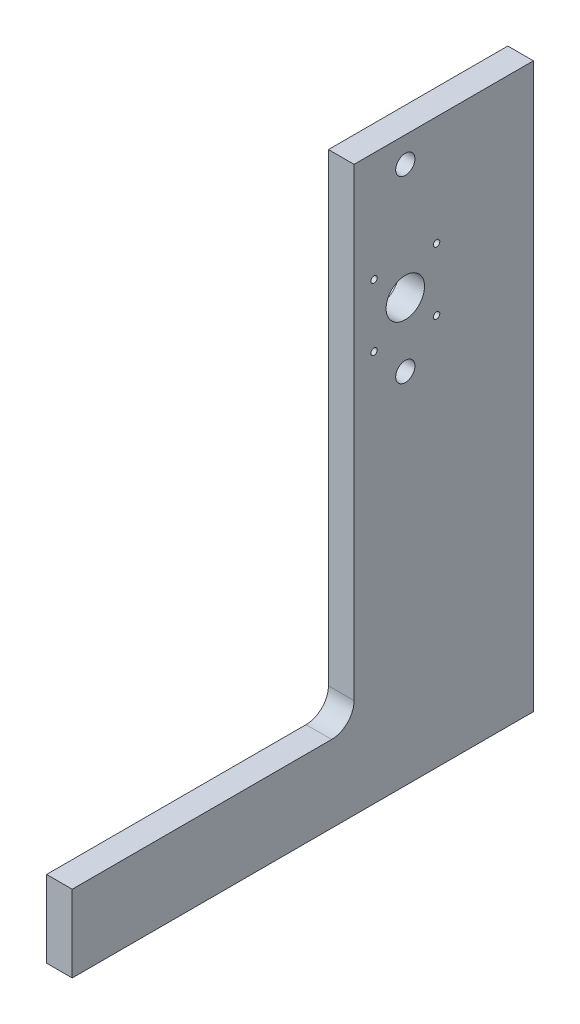
ISO-10303-21;
HEADER;
FILE_DESCRIPTION(('STEP AP214'),'2;1');
FILE_NAME('part.step','',(''),(''),'','','');
FILE_SCHEMA(('AUTOMOTIVE_DESIGN { 1 0 10303 214 1 1 1 1 }'));
ENDSEC;
DATA;
#1=APPLICATION_CONTEXT('core data for automotive mechanical design processes');
#2=APPLICATION_PROTOCOL_DEFINITION('international standard','automotive_design',2000,#1);
#3=PRODUCT_CONTEXT('',#1,'mechanical');
#4=PRODUCT('Part','Part','',(#3));
#5=PRODUCT_RELATED_PRODUCT_CATEGORY('part','',(#4));
#6=PRODUCT_DEFINITION_FORMATION('','',#4);
#7=PRODUCT_DEFINITION_CONTEXT('part definition',#1,'design');
#8=PRODUCT_DEFINITION('design','',#6,#7);
#9=PRODUCT_DEFINITION_SHAPE('','',#8);
#10=(LENGTH_UNIT() NAMED_UNIT(*) SI_UNIT(.MILLI.,.METRE.));
#11=(NAMED_UNIT(*) PLANE_ANGLE_UNIT() SI_UNIT($,.RADIAN.));
#12=(NAMED_UNIT(*) SI_UNIT($,.STERADIAN.) SOLID_ANGLE_UNIT());
#13=UNCERTAINTY_MEASURE_WITH_UNIT(LENGTH_MEASURE(1.E-05),#10,'distance_accuracy_value','');
#14=(GEOMETRIC_REPRESENTATION_CONTEXT(3) GLOBAL_UNCERTAINTY_ASSIGNED_CONTEXT((#13)) GLOBAL_UNIT_ASSIGNED_CONTEXT((#10,
#11,#12)) REPRESENTATION_CONTEXT('',''));
#15=CARTESIAN_POINT('',(0.,0.,0.));
#16=DIRECTION('',(0.,0.,1.));
#17=DIRECTION('',(1.,0.,0.));
#18=AXIS2_PLACEMENT_3D('',#15,#16,#17);
#19=CARTESIAN_POINT('',(12.7,49.2125,-128.5875));
#20=DIRECTION('',(-1.,0.,0.));
#21=DIRECTION('',(0.,0.,1.));
#22=AXIS2_PLACEMENT_3D('',#19,#20,#21);
#23=PLANE('',#22);
#24=CARTESIAN_POINT('',(12.7,194.061999988,-180.599999988));
#25=DIRECTION('',(1.,0.,0.));
#26=DIRECTION('',(0.,0.,-1.));
#27=AXIS2_PLACEMENT_3D('',#24,#25,#26);
#28=CIRCLE('',#27,1.58749999999999);
#29=CARTESIAN_POINT('',(12.7,194.061999988,-182.187499988));
#30=VERTEX_POINT('',#29);
#31=EDGE_CURVE('E186',#30,#30,#28,.T.);
#32=ORIENTED_EDGE('',*,*,#31,.F.);
#33=EDGE_LOOP('',(#32));
#34=FACE_BOUND('',#33,.T.);
#35=CARTESIAN_POINT('',(12.7,225.049999988,-180.599999988));
#36=DIRECTION('',(1.,0.,0.));
#37=DIRECTION('',(0.,0.,-1.));
#38=AXIS2_PLACEMENT_3D('',#35,#36,#37);
#39=CIRCLE('',#38,1.58749999999999);
#40=CARTESIAN_POINT('',(12.7,225.049999988,-182.187499988));
#41=VERTEX_POINT('',#40);
#42=EDGE_CURVE('E174',#41,#41,#39,.T.);
#43=ORIENTED_EDGE('',*,*,#42,.F.);
#44=EDGE_LOOP('',(#43));
#45=FACE_BOUND('',#44,.T.);
#46=CARTESIAN_POINT('',(12.7,209.55,-165.1));
#47=DIRECTION('',(1.,0.,0.));
#48=DIRECTION('',(0.,0.,-1.));
#49=AXIS2_PLACEMENT_3D('',#46,#47,#48);
#50=CIRCLE('',#49,9.52499999999999);
#51=CARTESIAN_POINT('',(12.7,209.55,-174.625));
#52=VERTEX_POINT('',#51);
#53=EDGE_CURVE('E162',#52,#52,#50,.T.);
#54=ORIENTED_EDGE('',*,*,#53,.F.);
#55=EDGE_LOOP('',(#54));
#56=FACE_BOUND('',#55,.T.);
#57=DIRECTION('',(0.,0.,-1.));
#58=VECTOR('',#57,1.);
#59=CARTESIAN_POINT('',(12.7,0.,0.));
#60=LINE('',#59,#58);
#61=CARTESIAN_POINT('',(12.7,0.,0.));
#62=VERTEX_POINT('',#61);
#63=CARTESIAN_POINT('',(12.7,0.,-228.6));
#64=VERTEX_POINT('',#63);
#65=EDGE_CURVE('E135',#62,#64,#60,.T.);
#66=ORIENTED_EDGE('',*,*,#65,.T.);
#67=DIRECTION('',(0.,1.,0.));
#68=VECTOR('',#67,1.);
#69=CARTESIAN_POINT('',(12.7,0.,-228.6));
#70=LINE('',#69,#68);
#71=CARTESIAN_POINT('',(12.7,279.400000000001,-228.6));
#72=VERTEX_POINT('',#71);
#73=EDGE_CURVE('E88',#64,#72,#70,.T.);
#74=ORIENTED_EDGE('',*,*,#73,.T.);
#75=DIRECTION('',(0.,0.,1.));
#76=VECTOR('',#75,1.);
#77=CARTESIAN_POINT('',(12.7,279.400000000001,-228.6));
#78=LINE('',#77,#76);
#79=CARTESIAN_POINT('',(12.7,279.400000000001,-139.7));
#80=VERTEX_POINT('',#79);
#81=EDGE_CURVE('E147',#72,#80,#78,.T.);
#82=ORIENTED_EDGE('',*,*,#81,.T.);
#83=DIRECTION('',(0.,-1.,0.));
#84=VECTOR('',#83,1.);
#85=CARTESIAN_POINT('',(12.7,279.400000000001,-139.7));
#86=LINE('',#85,#84);
#87=CARTESIAN_POINT('',(12.7,49.2125000000001,-139.7));
#88=VERTEX_POINT('',#87);
#89=EDGE_CURVE('E104',#80,#88,#86,.T.);
#90=ORIENTED_EDGE('',*,*,#89,.T.);
#91=CARTESIAN_POINT('',(12.7,49.2125,-128.5875));
#92=DIRECTION('',(-1.,0.,0.));
#93=DIRECTION('',(0.,0.,1.));
#94=AXIS2_PLACEMENT_3D('',#91,#92,#93);
#95=CIRCLE('',#94,11.1125);
#96=CARTESIAN_POINT('',(12.7,38.1,-128.5875));
#97=VERTEX_POINT('',#96);
#98=EDGE_CURVE('E98',#88,#97,#95,.T.);
#99=ORIENTED_EDGE('',*,*,#98,.T.);
#100=DIRECTION('',(0.,0.,1.));
#101=VECTOR('',#100,1.);
#102=CARTESIAN_POINT('',(12.7,38.1,-128.5875));
#103=LINE('',#102,#101);
#104=CARTESIAN_POINT('',(12.7,38.1,0.));
#105=VERTEX_POINT('',#104);
#106=EDGE_CURVE('E102',#97,#105,#103,.T.);
#107=ORIENTED_EDGE('',*,*,#106,.T.);
#108=DIRECTION('',(0.,-1.,0.));
#109=VECTOR('',#108,1.);
#110=CARTESIAN_POINT('',(12.7,0.,0.));
#111=LINE('',#110,#109);
#112=EDGE_CURVE('E48',#105,#62,#111,.T.);
#113=ORIENTED_EDGE('',*,*,#112,.T.);
#114=EDGE_LOOP('',(#66,#74,#82,#90,#99,#107,#113));
#115=FACE_BOUND('',#114,.T.);
#116=CARTESIAN_POINT('',(12.7,266.7,-165.1));
#117=DIRECTION('',(1.,0.,0.));
#118=DIRECTION('',(0.,0.,-1.));
#119=AXIS2_PLACEMENT_3D('',#116,#117,#118);
#120=CIRCLE('',#119,4.76250000000001);
#121=CARTESIAN_POINT('',(12.7,266.7,-169.8625));
#122=VERTEX_POINT('',#121);
#123=EDGE_CURVE('E126',#122,#122,#120,.T.);
#124=ORIENTED_EDGE('',*,*,#123,.F.);
#125=EDGE_LOOP('',(#124));
#126=FACE_BOUND('',#125,.T.);
#127=CARTESIAN_POINT('',(12.7,177.8,-165.100000000001));
#128=DIRECTION('',(1.,0.,0.));
#129=DIRECTION('',(0.,0.,-1.));
#130=AXIS2_PLACEMENT_3D('',#127,#128,#129);
#131=CIRCLE('',#130,4.76250000000001);
#132=CARTESIAN_POINT('',(12.7,177.8,-169.862500000001));
#133=VERTEX_POINT('',#132);
#134=EDGE_CURVE('E168',#133,#133,#131,.T.);
#135=ORIENTED_EDGE('',*,*,#134,.F.);
#136=EDGE_LOOP('',(#135));
#137=FACE_BOUND('',#136,.T.);
#138=CARTESIAN_POINT('',(12.7,225.049999988,-149.611999988));
#139=DIRECTION('',(1.,0.,0.));
#140=DIRECTION('',(0.,0.,-1.));
#141=AXIS2_PLACEMENT_3D('',#138,#139,#140);
#142=CIRCLE('',#141,1.58749999999999);
#143=CARTESIAN_POINT('',(12.7,225.049999988,-151.199499988));
#144=VERTEX_POINT('',#143);
#145=EDGE_CURVE('E180',#144,#144,#142,.T.);
#146=ORIENTED_EDGE('',*,*,#145,.F.);
#147=EDGE_LOOP('',(#146));
#148=FACE_BOUND('',#147,.T.);
#149=CARTESIAN_POINT('',(12.7,194.061999988,-149.611999988));
#150=DIRECTION('',(1.,0.,0.));
#151=DIRECTION('',(0.,0.,-1.));
#152=AXIS2_PLACEMENT_3D('',#149,#150,#151);
#153=CIRCLE('',#152,1.58749999999999);
#154=CARTESIAN_POINT('',(12.7,194.061999988,-151.199499988));
#155=VERTEX_POINT('',#154);
#156=EDGE_CURVE('E192',#155,#155,#153,.T.);
#157=ORIENTED_EDGE('',*,*,#156,.F.);
#158=EDGE_LOOP('',(#157));
#159=FACE_BOUND('',#158,.T.);
#160=ADVANCED_FACE('F31',(#34,#45,#56,#115,#126,#137,#148,#159),#23,.F.);
#161=CARTESIAN_POINT('',(0.,49.2125,-128.5875));
#162=DIRECTION('',(-1.,0.,0.));
#163=DIRECTION('',(0.,0.,1.));
#164=AXIS2_PLACEMENT_3D('',#161,#162,#163);
#165=PLANE('',#164);
#166=CARTESIAN_POINT('',(0.,194.061999988,-180.599999988));
#167=DIRECTION('',(1.,0.,0.));
#168=DIRECTION('',(0.,0.,-1.));
#169=AXIS2_PLACEMENT_3D('',#166,#167,#168);
#170=CIRCLE('',#169,1.58749999999999);
#171=CARTESIAN_POINT('',(0.,194.061999988,-182.187499988));
#172=VERTEX_POINT('',#171);
#173=EDGE_CURVE('E189',#172,#172,#170,.T.);
#174=ORIENTED_EDGE('',*,*,#173,.T.);
#175=EDGE_LOOP('',(#174));
#176=FACE_BOUND('',#175,.T.);
#177=CARTESIAN_POINT('',(0.,225.049999988,-180.599999988));
#178=DIRECTION('',(1.,0.,0.));
#179=DIRECTION('',(0.,0.,-1.));
#180=AXIS2_PLACEMENT_3D('',#177,#178,#179);
#181=CIRCLE('',#180,1.58749999999999);
#182=CARTESIAN_POINT('',(0.,225.049999988,-182.187499988));
#183=VERTEX_POINT('',#182);
#184=EDGE_CURVE('E177',#183,#183,#181,.T.);
#185=ORIENTED_EDGE('',*,*,#184,.T.);
#186=EDGE_LOOP('',(#185));
#187=FACE_BOUND('',#186,.T.);
#188=CARTESIAN_POINT('',(0.,209.55,-165.1));
#189=DIRECTION('',(1.,0.,0.));
#190=DIRECTION('',(0.,0.,-1.));
#191=AXIS2_PLACEMENT_3D('',#188,#189,#190);
#192=CIRCLE('',#191,9.52499999999999);
#193=CARTESIAN_POINT('',(0.,209.55,-174.625));
#194=VERTEX_POINT('',#193);
#195=EDGE_CURVE('E165',#194,#194,#192,.T.);
#196=ORIENTED_EDGE('',*,*,#195,.T.);
#197=EDGE_LOOP('',(#196));
#198=FACE_BOUND('',#197,.T.);
#199=DIRECTION('',(0.,0.,-1.));
#200=VECTOR('',#199,1.);
#201=CARTESIAN_POINT('',(0.,0.,0.));
#202=LINE('',#201,#200);
#203=CARTESIAN_POINT('',(0.,0.,0.));
#204=VERTEX_POINT('',#203);
#205=CARTESIAN_POINT('',(0.,0.,-228.6));
#206=VERTEX_POINT('',#205);
#207=EDGE_CURVE('E122',#204,#206,#202,.T.);
#208=ORIENTED_EDGE('',*,*,#207,.F.);
#209=DIRECTION('',(0.,-1.,0.));
#210=VECTOR('',#209,1.);
#211=CARTESIAN_POINT('',(0.,0.,0.));
#212=LINE('',#211,#210);
#213=CARTESIAN_POINT('',(0.,38.1,0.));
#214=VERTEX_POINT('',#213);
#215=EDGE_CURVE('E80',#214,#204,#212,.T.);
#216=ORIENTED_EDGE('',*,*,#215,.F.);
#217=DIRECTION('',(0.,0.,1.));
#218=VECTOR('',#217,1.);
#219=CARTESIAN_POINT('',(0.,38.1,-128.5875));
#220=LINE('',#219,#218);
#221=CARTESIAN_POINT('',(0.,38.1,-128.5875));
#222=VERTEX_POINT('',#221);
#223=EDGE_CURVE('E74',#222,#214,#220,.T.);
#224=ORIENTED_EDGE('',*,*,#223,.F.);
#225=CARTESIAN_POINT('',(0.,49.2125,-128.5875));
#226=DIRECTION('',(-1.,0.,0.));
#227=DIRECTION('',(0.,0.,1.));
#228=AXIS2_PLACEMENT_3D('',#225,#226,#227);
#229=CIRCLE('',#228,11.1125);
#230=CARTESIAN_POINT('',(0.,49.2125000000001,-139.7));
#231=VERTEX_POINT('',#230);
#232=EDGE_CURVE('E112',#231,#222,#229,.T.);
#233=ORIENTED_EDGE('',*,*,#232,.F.);
#234=DIRECTION('',(0.,-1.,0.));
#235=VECTOR('',#234,1.);
#236=CARTESIAN_POINT('',(0.,279.400000000001,-139.7));
#237=LINE('',#236,#235);
#238=CARTESIAN_POINT('',(0.,279.400000000001,-139.7));
#239=VERTEX_POINT('',#238);
#240=EDGE_CURVE('E130',#239,#231,#237,.T.);
#241=ORIENTED_EDGE('',*,*,#240,.F.);
#242=DIRECTION('',(0.,0.,1.));
#243=VECTOR('',#242,1.);
#244=CARTESIAN_POINT('',(0.,279.400000000001,-228.6));
#245=LINE('',#244,#243);
#246=CARTESIAN_POINT('',(0.,279.400000000001,-228.6));
#247=VERTEX_POINT('',#246);
#248=EDGE_CURVE('E128',#247,#239,#245,.T.);
#249=ORIENTED_EDGE('',*,*,#248,.F.);
#250=DIRECTION('',(0.,1.,0.));
#251=VECTOR('',#250,1.);
#252=CARTESIAN_POINT('',(0.,0.,-228.6));
#253=LINE('',#252,#251);
#254=EDGE_CURVE('E125',#206,#247,#253,.T.);
#255=ORIENTED_EDGE('',*,*,#254,.F.);
#256=EDGE_LOOP('',(#208,#216,#224,#233,#241,#249,#255));
#257=FACE_BOUND('',#256,.T.);
#258=CARTESIAN_POINT('',(0.,266.7,-165.1));
#259=DIRECTION('',(1.,0.,0.));
#260=DIRECTION('',(0.,0.,-1.));
#261=AXIS2_PLACEMENT_3D('',#258,#259,#260);
#262=CIRCLE('',#261,4.76250000000001);
#263=CARTESIAN_POINT('',(0.,266.7,-169.8625));
#264=VERTEX_POINT('',#263);
#265=EDGE_CURVE('E159',#264,#264,#262,.T.);
#266=ORIENTED_EDGE('',*,*,#265,.T.);
#267=EDGE_LOOP('',(#266));
#268=FACE_BOUND('',#267,.T.);
#269=CARTESIAN_POINT('',(0.,177.8,-165.100000000001));
#270=DIRECTION('',(1.,0.,0.));
#271=DIRECTION('',(0.,0.,-1.));
#272=AXIS2_PLACEMENT_3D('',#269,#270,#271);
#273=CIRCLE('',#272,4.76250000000001);
#274=CARTESIAN_POINT('',(0.,177.8,-169.862500000001));
#275=VERTEX_POINT('',#274);
#276=EDGE_CURVE('E171',#275,#275,#273,.T.);
#277=ORIENTED_EDGE('',*,*,#276,.T.);
#278=EDGE_LOOP('',(#277));
#279=FACE_BOUND('',#278,.T.);
#280=CARTESIAN_POINT('',(0.,225.049999988,-149.611999988));
#281=DIRECTION('',(1.,0.,0.));
#282=DIRECTION('',(0.,0.,-1.));
#283=AXIS2_PLACEMENT_3D('',#280,#281,#282);
#284=CIRCLE('',#283,1.58749999999999);
#285=CARTESIAN_POINT('',(0.,225.049999988,-151.199499988));
#286=VERTEX_POINT('',#285);
#287=EDGE_CURVE('E183',#286,#286,#284,.T.);
#288=ORIENTED_EDGE('',*,*,#287,.T.);
#289=EDGE_LOOP('',(#288));
#290=FACE_BOUND('',#289,.T.);
#291=CARTESIAN_POINT('',(0.,194.061999988,-149.611999988));
#292=DIRECTION('',(1.,0.,0.));
#293=DIRECTION('',(0.,0.,-1.));
#294=AXIS2_PLACEMENT_3D('',#291,#292,#293);
#295=CIRCLE('',#294,1.58749999999999);
#296=CARTESIAN_POINT('',(0.,194.061999988,-151.199499988));
#297=VERTEX_POINT('',#296);
#298=EDGE_CURVE('E195',#297,#297,#295,.T.);
#299=ORIENTED_EDGE('',*,*,#298,.T.);
#300=EDGE_LOOP('',(#299));
#301=FACE_BOUND('',#300,.T.);
#302=ADVANCED_FACE('F151',(#176,#187,#198,#257,#268,#279,#290,#301),#165,.T.);
#303=CARTESIAN_POINT('',(12.7,0.,0.));
#304=DIRECTION('',(0.,1.,0.));
#305=DIRECTION('',(0.,0.,1.));
#306=AXIS2_PLACEMENT_3D('',#303,#304,#305);
#307=PLANE('',#306);
#308=ORIENTED_EDGE('',*,*,#207,.T.);
#309=DIRECTION('',(-1.,0.,0.));
#310=VECTOR('',#309,1.);
#311=CARTESIAN_POINT('',(12.7,0.,-228.6));
#312=LINE('',#311,#310);
#313=EDGE_CURVE('E11',#64,#206,#312,.T.);
#314=ORIENTED_EDGE('',*,*,#313,.F.);
#315=ORIENTED_EDGE('',*,*,#65,.F.);
#316=DIRECTION('',(-1.,0.,0.));
#317=VECTOR('',#316,1.);
#318=CARTESIAN_POINT('',(12.7,0.,0.));
#319=LINE('',#318,#317);
#320=EDGE_CURVE('E118',#62,#204,#319,.T.);
#321=ORIENTED_EDGE('',*,*,#320,.T.);
#322=EDGE_LOOP('',(#308,#314,#315,#321));
#323=FACE_BOUND('',#322,.T.);
#324=ADVANCED_FACE('F33',(#323),#307,.F.);
#325=CARTESIAN_POINT('',(12.7,0.,-228.6));
#326=DIRECTION('',(0.,0.,1.));
#327=DIRECTION('',(1.,0.,0.));
#328=AXIS2_PLACEMENT_3D('',#325,#326,#327);
#329=PLANE('',#328);
#330=ORIENTED_EDGE('',*,*,#254,.T.);
#331=DIRECTION('',(-1.,0.,0.));
#332=VECTOR('',#331,1.);
#333=CARTESIAN_POINT('',(12.7,279.400000000001,-228.6));
#334=LINE('',#333,#332);
#335=EDGE_CURVE('E40',#72,#247,#334,.T.);
#336=ORIENTED_EDGE('',*,*,#335,.F.);
#337=ORIENTED_EDGE('',*,*,#73,.F.);
#338=ORIENTED_EDGE('',*,*,#313,.T.);
#339=EDGE_LOOP('',(#330,#336,#337,#338));
#340=FACE_BOUND('',#339,.T.);
#341=ADVANCED_FACE('F228',(#340),#329,.F.);
#342=CARTESIAN_POINT('',(12.7,279.400000000001,-228.6));
#343=DIRECTION('',(0.,-1.,0.));
#344=DIRECTION('',(0.,0.,-1.));
#345=AXIS2_PLACEMENT_3D('',#342,#343,#344);
#346=PLANE('',#345);
#347=ORIENTED_EDGE('',*,*,#248,.T.);
#348=DIRECTION('',(-1.,0.,0.));
#349=VECTOR('',#348,1.);
#350=CARTESIAN_POINT('',(12.7,279.400000000001,-139.7));
#351=LINE('',#350,#349);
#352=EDGE_CURVE('E139',#80,#239,#351,.T.);
#353=ORIENTED_EDGE('',*,*,#352,.F.);
#354=ORIENTED_EDGE('',*,*,#81,.F.);
#355=ORIENTED_EDGE('',*,*,#335,.T.);
#356=EDGE_LOOP('',(#347,#353,#354,#355));
#357=FACE_BOUND('',#356,.T.);
#358=ADVANCED_FACE('F145',(#357),#346,.F.);
#359=CARTESIAN_POINT('',(12.7,279.400000000001,-139.7));
#360=DIRECTION('',(0.,0.,-1.));
#361=DIRECTION('',(-1.,0.,0.));
#362=AXIS2_PLACEMENT_3D('',#359,#360,#361);
#363=PLANE('',#362);
#364=ORIENTED_EDGE('',*,*,#240,.T.);
#365=DIRECTION('',(-1.,0.,0.));
#366=VECTOR('',#365,1.);
#367=CARTESIAN_POINT('',(12.7,49.2125000000001,-139.7));
#368=LINE('',#367,#366);
#369=EDGE_CURVE('E113',#88,#231,#368,.T.);
#370=ORIENTED_EDGE('',*,*,#369,.F.);
#371=ORIENTED_EDGE('',*,*,#89,.F.);
#372=ORIENTED_EDGE('',*,*,#352,.T.);
#373=EDGE_LOOP('',(#364,#370,#371,#372));
#374=FACE_BOUND('',#373,.T.);
#375=ADVANCED_FACE('F154',(#374),#363,.F.);
#376=CARTESIAN_POINT('',(12.7,49.2125,-128.5875));
#377=DIRECTION('',(-1.,0.,0.));
#378=DIRECTION('',(0.,0.,1.));
#379=AXIS2_PLACEMENT_3D('',#376,#377,#378);
#380=CYLINDRICAL_SURFACE('',#379,11.1125);
#381=ORIENTED_EDGE('',*,*,#232,.T.);
#382=DIRECTION('',(-1.,0.,0.));
#383=VECTOR('',#382,1.);
#384=CARTESIAN_POINT('',(12.7,38.1,-128.5875));
#385=LINE('',#384,#383);
#386=EDGE_CURVE('E109',#97,#222,#385,.T.);
#387=ORIENTED_EDGE('',*,*,#386,.F.);
#388=ORIENTED_EDGE('',*,*,#98,.F.);
#389=ORIENTED_EDGE('',*,*,#369,.T.);
#390=EDGE_LOOP('',(#381,#387,#388,#389));
#391=FACE_BOUND('',#390,.T.);
#392=ADVANCED_FACE('F110',(#391),#380,.F.);
#393=CARTESIAN_POINT('',(12.7,38.1,-128.5875));
#394=DIRECTION('',(0.,-1.,0.));
#395=DIRECTION('',(0.,0.,-1.));
#396=AXIS2_PLACEMENT_3D('',#393,#394,#395);
#397=PLANE('',#396);
#398=ORIENTED_EDGE('',*,*,#223,.T.);
#399=DIRECTION('',(-1.,0.,0.));
#400=VECTOR('',#399,1.);
#401=CARTESIAN_POINT('',(12.7,38.1,0.));
#402=LINE('',#401,#400);
#403=EDGE_CURVE('E114',#105,#214,#402,.T.);
#404=ORIENTED_EDGE('',*,*,#403,.F.);
#405=ORIENTED_EDGE('',*,*,#106,.F.);
#406=ORIENTED_EDGE('',*,*,#386,.T.);
#407=EDGE_LOOP('',(#398,#404,#405,#406));
#408=FACE_BOUND('',#407,.T.);
#409=ADVANCED_FACE('F116',(#408),#397,.F.);
#410=CARTESIAN_POINT('',(12.7,0.,0.));
#411=DIRECTION('',(0.,0.,-1.));
#412=DIRECTION('',(-1.,0.,0.));
#413=AXIS2_PLACEMENT_3D('',#410,#411,#412);
#414=PLANE('',#413);
#415=ORIENTED_EDGE('',*,*,#215,.T.);
#416=ORIENTED_EDGE('',*,*,#320,.F.);
#417=ORIENTED_EDGE('',*,*,#112,.F.);
#418=ORIENTED_EDGE('',*,*,#403,.T.);
#419=EDGE_LOOP('',(#415,#416,#417,#418));
#420=FACE_BOUND('',#419,.T.);
#421=ADVANCED_FACE('F218',(#420),#414,.F.);
#422=CARTESIAN_POINT('',(12.7,266.7,-165.1));
#423=DIRECTION('',(-1.,0.,0.));
#424=DIRECTION('',(0.,0.,1.));
#425=AXIS2_PLACEMENT_3D('',#422,#423,#424);
#426=CYLINDRICAL_SURFACE('',#425,4.76250000000001);
#427=ORIENTED_EDGE('',*,*,#123,.T.);
#428=EDGE_LOOP('',(#427));
#429=FACE_BOUND('',#428,.T.);
#430=ORIENTED_EDGE('',*,*,#265,.F.);
#431=EDGE_LOOP('',(#430));
#432=FACE_BOUND('',#431,.T.);
#433=ADVANCED_FACE('F215',(#429,#432),#426,.F.);
#434=CARTESIAN_POINT('',(12.7,209.55,-165.1));
#435=DIRECTION('',(-1.,0.,0.));
#436=DIRECTION('',(0.,0.,1.));
#437=AXIS2_PLACEMENT_3D('',#434,#435,#436);
#438=CYLINDRICAL_SURFACE('',#437,9.52499999999999);
#439=ORIENTED_EDGE('',*,*,#53,.T.);
#440=EDGE_LOOP('',(#439));
#441=FACE_BOUND('',#440,.T.);
#442=ORIENTED_EDGE('',*,*,#195,.F.);
#443=EDGE_LOOP('',(#442));
#444=FACE_BOUND('',#443,.T.);
#445=ADVANCED_FACE('F287',(#441,#444),#438,.F.);
#446=CARTESIAN_POINT('',(12.7,177.8,-165.100000000001));
#447=DIRECTION('',(-1.,0.,0.));
#448=DIRECTION('',(0.,0.,1.));
#449=AXIS2_PLACEMENT_3D('',#446,#447,#448);
#450=CYLINDRICAL_SURFACE('',#449,4.76250000000001);
#451=ORIENTED_EDGE('',*,*,#134,.T.);
#452=EDGE_LOOP('',(#451));
#453=FACE_BOUND('',#452,.T.);
#454=ORIENTED_EDGE('',*,*,#276,.F.);
#455=EDGE_LOOP('',(#454));
#456=FACE_BOUND('',#455,.T.);
#457=ADVANCED_FACE('F295',(#453,#456),#450,.F.);
#458=CARTESIAN_POINT('',(12.7,225.049999988,-180.599999988));
#459=DIRECTION('',(-1.,0.,0.));
#460=DIRECTION('',(0.,0.,1.));
#461=AXIS2_PLACEMENT_3D('',#458,#459,#460);
#462=CYLINDRICAL_SURFACE('',#461,1.58749999999999);
#463=ORIENTED_EDGE('',*,*,#42,.T.);
#464=EDGE_LOOP('',(#463));
#465=FACE_BOUND('',#464,.T.);
#466=ORIENTED_EDGE('',*,*,#184,.F.);
#467=EDGE_LOOP('',(#466));
#468=FACE_BOUND('',#467,.T.);
#469=ADVANCED_FACE('F303',(#465,#468),#462,.F.);
#470=CARTESIAN_POINT('',(12.7,225.049999988,-149.611999988));
#471=DIRECTION('',(-1.,0.,0.));
#472=DIRECTION('',(0.,0.,1.));
#473=AXIS2_PLACEMENT_3D('',#470,#471,#472);
#474=CYLINDRICAL_SURFACE('',#473,1.58749999999999);
#475=ORIENTED_EDGE('',*,*,#145,.T.);
#476=EDGE_LOOP('',(#475));
#477=FACE_BOUND('',#476,.T.);
#478=ORIENTED_EDGE('',*,*,#287,.F.);
#479=EDGE_LOOP('',(#478));
#480=FACE_BOUND('',#479,.T.);
#481=ADVANCED_FACE('F312',(#477,#480),#474,.F.);
#482=CARTESIAN_POINT('',(12.7,194.061999988,-180.599999988));
#483=DIRECTION('',(-1.,0.,0.));
#484=DIRECTION('',(0.,0.,1.));
#485=AXIS2_PLACEMENT_3D('',#482,#483,#484);
#486=CYLINDRICAL_SURFACE('',#485,1.58749999999999);
#487=ORIENTED_EDGE('',*,*,#31,.T.);
#488=EDGE_LOOP('',(#487));
#489=FACE_BOUND('',#488,.T.);
#490=ORIENTED_EDGE('',*,*,#173,.F.);
#491=EDGE_LOOP('',(#490));
#492=FACE_BOUND('',#491,.T.);
#493=ADVANCED_FACE('F321',(#489,#492),#486,.F.);
#494=CARTESIAN_POINT('',(12.7,194.061999988,-149.611999988));
#495=DIRECTION('',(-1.,0.,0.));
#496=DIRECTION('',(0.,0.,1.));
#497=AXIS2_PLACEMENT_3D('',#494,#495,#496);
#498=CYLINDRICAL_SURFACE('',#497,1.58749999999999);
#499=ORIENTED_EDGE('',*,*,#156,.T.);
#500=EDGE_LOOP('',(#499));
#501=FACE_BOUND('',#500,.T.);
#502=ORIENTED_EDGE('',*,*,#298,.F.);
#503=EDGE_LOOP('',(#502));
#504=FACE_BOUND('',#503,.T.);
#505=ADVANCED_FACE('F201',(#501,#504),#498,.F.);
#506=CLOSED_SHELL('',(#160,#302,#324,#341,#358,#375,#392,#409,#421,#433,#445,#457,#469,#481,
#493,#505));
#507=MANIFOLD_SOLID_BREP('B2',#506);
#508=ADVANCED_BREP_SHAPE_REPRESENTATION('',(#18,#507),#14);
#509=SHAPE_DEFINITION_REPRESENTATION(#9,#508);
ENDSEC;
END-ISO-10303-21;
